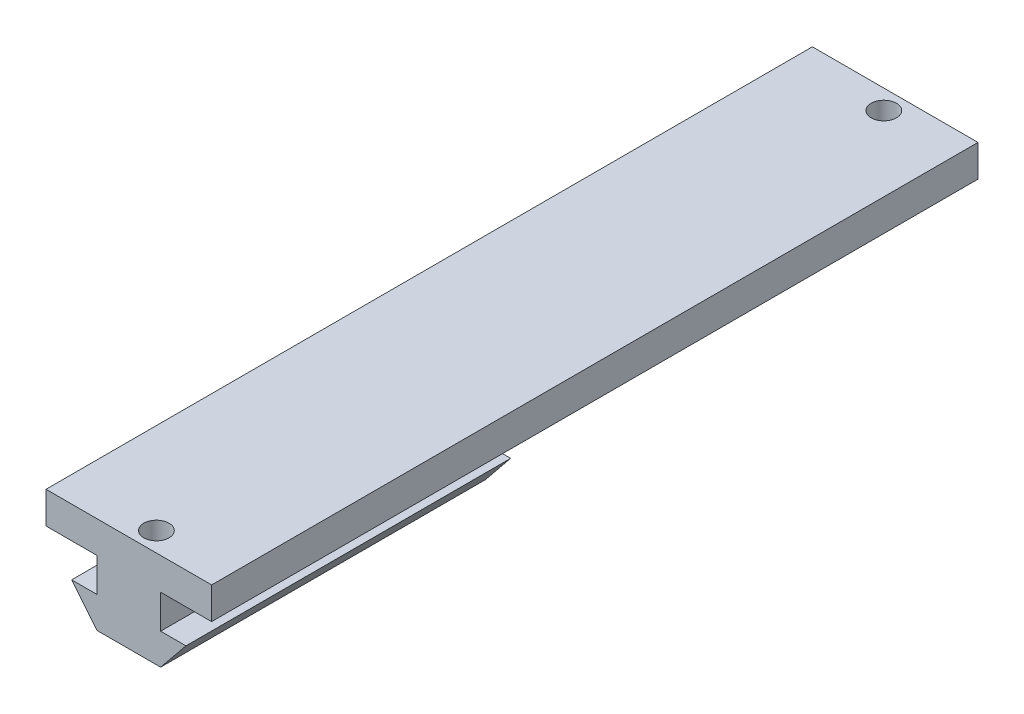
ISO-10303-21;
HEADER;
FILE_DESCRIPTION(('STEP AP214'),'2;1');
FILE_NAME('part.step','',(''),(''),'','','');
FILE_SCHEMA(('AUTOMOTIVE_DESIGN { 1 0 10303 214 1 1 1 1 }'));
ENDSEC;
DATA;
#1=APPLICATION_CONTEXT('core data for automotive mechanical design processes');
#2=APPLICATION_PROTOCOL_DEFINITION('international standard','automotive_design',2000,#1);
#3=PRODUCT_CONTEXT('',#1,'mechanical');
#4=PRODUCT('Part','Part','',(#3));
#5=PRODUCT_RELATED_PRODUCT_CATEGORY('part','',(#4));
#6=PRODUCT_DEFINITION_FORMATION('','',#4);
#7=PRODUCT_DEFINITION_CONTEXT('part definition',#1,'design');
#8=PRODUCT_DEFINITION('design','',#6,#7);
#9=PRODUCT_DEFINITION_SHAPE('','',#8);
#10=(LENGTH_UNIT() NAMED_UNIT(*) SI_UNIT(.MILLI.,.METRE.));
#11=(NAMED_UNIT(*) PLANE_ANGLE_UNIT() SI_UNIT($,.RADIAN.));
#12=(NAMED_UNIT(*) SI_UNIT($,.STERADIAN.) SOLID_ANGLE_UNIT());
#13=UNCERTAINTY_MEASURE_WITH_UNIT(LENGTH_MEASURE(1.E-05),#10,'distance_accuracy_value','');
#14=(GEOMETRIC_REPRESENTATION_CONTEXT(3) GLOBAL_UNCERTAINTY_ASSIGNED_CONTEXT((#13)) GLOBAL_UNIT_ASSIGNED_CONTEXT((#10,
#11,#12)) REPRESENTATION_CONTEXT('',''));
#15=CARTESIAN_POINT('',(0.,0.,0.));
#16=DIRECTION('',(0.,0.,1.));
#17=DIRECTION('',(1.,0.,0.));
#18=AXIS2_PLACEMENT_3D('',#15,#16,#17);
#19=CARTESIAN_POINT('',(12.75,4.9,59.));
#20=DIRECTION('',(-1.,0.,0.));
#21=DIRECTION('',(0.,0.,1.));
#22=AXIS2_PLACEMENT_3D('',#19,#20,#21);
#23=PLANE('',#22);
#24=DIRECTION('',(0.,0.,-1.));
#25=VECTOR('',#24,1.);
#26=CARTESIAN_POINT('',(12.75,0.,59.));
#27=LINE('',#26,#25);
#28=CARTESIAN_POINT('',(12.75,0.,59.));
#29=VERTEX_POINT('',#28);
#30=CARTESIAN_POINT('',(12.75,0.,-59.));
#31=VERTEX_POINT('',#30);
#32=EDGE_CURVE('E203',#29,#31,#27,.T.);
#33=ORIENTED_EDGE('',*,*,#32,.T.);
#34=DIRECTION('',(0.,-1.,0.));
#35=VECTOR('',#34,1.);
#36=CARTESIAN_POINT('',(12.75,4.9,-59.));
#37=LINE('',#36,#35);
#38=CARTESIAN_POINT('',(12.75,4.9,-59.));
#39=VERTEX_POINT('',#38);
#40=EDGE_CURVE('E11',#39,#31,#37,.T.);
#41=ORIENTED_EDGE('',*,*,#40,.F.);
#42=DIRECTION('',(0.,0.,-1.));
#43=VECTOR('',#42,1.);
#44=CARTESIAN_POINT('',(12.75,4.9,59.));
#45=LINE('',#44,#43);
#46=CARTESIAN_POINT('',(12.75,4.9,59.));
#47=VERTEX_POINT('',#46);
#48=EDGE_CURVE('E215',#47,#39,#45,.T.);
#49=ORIENTED_EDGE('',*,*,#48,.F.);
#50=DIRECTION('',(0.,-1.,0.));
#51=VECTOR('',#50,1.);
#52=CARTESIAN_POINT('',(12.75,4.9,59.));
#53=LINE('',#52,#51);
#54=EDGE_CURVE('E222',#47,#29,#53,.T.);
#55=ORIENTED_EDGE('',*,*,#54,.T.);
#56=EDGE_LOOP('',(#33,#41,#49,#55));
#57=FACE_BOUND('',#56,.T.);
#58=ADVANCED_FACE('F45',(#57),#23,.F.);
#59=CARTESIAN_POINT('',(-12.75,4.9,-59.));
#60=DIRECTION('',(0.,0.,1.));
#61=DIRECTION('',(1.,0.,0.));
#62=AXIS2_PLACEMENT_3D('',#59,#60,#61);
#63=PLANE('',#62);
#64=DIRECTION('',(-1.,0.,0.));
#65=VECTOR('',#64,1.);
#66=CARTESIAN_POINT('',(-12.75,0.,-59.));
#67=LINE('',#66,#65);
#68=CARTESIAN_POINT('',(-12.75,0.,-59.));
#69=VERTEX_POINT('',#68);
#70=EDGE_CURVE('E225',#31,#69,#67,.T.);
#71=ORIENTED_EDGE('',*,*,#70,.T.);
#72=DIRECTION('',(0.,-1.,0.));
#73=VECTOR('',#72,1.);
#74=CARTESIAN_POINT('',(-12.75,4.9,-59.));
#75=LINE('',#74,#73);
#76=CARTESIAN_POINT('',(-12.75,4.9,-59.));
#77=VERTEX_POINT('',#76);
#78=EDGE_CURVE('E53',#77,#69,#75,.T.);
#79=ORIENTED_EDGE('',*,*,#78,.F.);
#80=DIRECTION('',(-1.,0.,0.));
#81=VECTOR('',#80,1.);
#82=CARTESIAN_POINT('',(-12.75,4.9,-59.));
#83=LINE('',#82,#81);
#84=EDGE_CURVE('E97',#39,#77,#83,.T.);
#85=ORIENTED_EDGE('',*,*,#84,.F.);
#86=ORIENTED_EDGE('',*,*,#40,.T.);
#87=EDGE_LOOP('',(#71,#79,#85,#86));
#88=FACE_BOUND('',#87,.T.);
#89=ADVANCED_FACE('F262',(#88),#63,.F.);
#90=CARTESIAN_POINT('',(-12.75,4.9,59.));
#91=DIRECTION('',(1.,0.,0.));
#92=DIRECTION('',(0.,0.,-1.));
#93=AXIS2_PLACEMENT_3D('',#90,#91,#92);
#94=PLANE('',#93);
#95=DIRECTION('',(0.,0.,1.));
#96=VECTOR('',#95,1.);
#97=CARTESIAN_POINT('',(-12.75,0.,59.));
#98=LINE('',#97,#96);
#99=CARTESIAN_POINT('',(-12.75,0.,59.));
#100=VERTEX_POINT('',#99);
#101=EDGE_CURVE('E227',#69,#100,#98,.T.);
#102=ORIENTED_EDGE('',*,*,#101,.T.);
#103=DIRECTION('',(0.,-1.,0.));
#104=VECTOR('',#103,1.);
#105=CARTESIAN_POINT('',(-12.75,4.9,59.));
#106=LINE('',#105,#104);
#107=CARTESIAN_POINT('',(-12.75,4.9,59.));
#108=VERTEX_POINT('',#107);
#109=EDGE_CURVE('E231',#108,#100,#106,.T.);
#110=ORIENTED_EDGE('',*,*,#109,.F.);
#111=DIRECTION('',(0.,0.,1.));
#112=VECTOR('',#111,1.);
#113=CARTESIAN_POINT('',(-12.75,4.9,59.));
#114=LINE('',#113,#112);
#115=EDGE_CURVE('E219',#77,#108,#114,.T.);
#116=ORIENTED_EDGE('',*,*,#115,.F.);
#117=ORIENTED_EDGE('',*,*,#78,.T.);
#118=EDGE_LOOP('',(#102,#110,#116,#117));
#119=FACE_BOUND('',#118,.T.);
#120=ADVANCED_FACE('F238',(#119),#94,.F.);
#121=CARTESIAN_POINT('',(-12.75,4.9,59.));
#122=DIRECTION('',(0.,0.,-1.));
#123=DIRECTION('',(-1.,0.,0.));
#124=AXIS2_PLACEMENT_3D('',#121,#122,#123);
#125=PLANE('',#124);
#126=DIRECTION('',(1.,0.,0.));
#127=VECTOR('',#126,1.);
#128=CARTESIAN_POINT('',(-12.75,0.,59.));
#129=LINE('',#128,#127);
#130=CARTESIAN_POINT('',(-4.9,0.,59.));
#131=VERTEX_POINT('',#130);
#132=EDGE_CURVE('E217',#100,#131,#129,.T.);
#133=ORIENTED_EDGE('',*,*,#132,.T.);
#134=DIRECTION('',(0.,-1.,0.));
#135=VECTOR('',#134,1.);
#136=CARTESIAN_POINT('',(-4.9,0.,59.));
#137=LINE('',#136,#135);
#138=CARTESIAN_POINT('',(-4.9,-5.2,59.));
#139=VERTEX_POINT('',#138);
#140=EDGE_CURVE('E60',#131,#139,#137,.T.);
#141=ORIENTED_EDGE('',*,*,#140,.T.);
#142=DIRECTION('',(-1.,0.,0.));
#143=VECTOR('',#142,1.);
#144=CARTESIAN_POINT('',(-4.9,-5.2,59.));
#145=LINE('',#144,#143);
#146=CARTESIAN_POINT('',(-8.8,-5.2,59.));
#147=VERTEX_POINT('',#146);
#148=EDGE_CURVE('E188',#139,#147,#145,.T.);
#149=ORIENTED_EDGE('',*,*,#148,.T.);
#150=DIRECTION('',(0.630592625094466,-0.776114000116266,0.));
#151=VECTOR('',#150,1.);
#152=CARTESIAN_POINT('',(-8.8,-5.2,59.));
#153=LINE('',#152,#151);
#154=CARTESIAN_POINT('',(-4.9,-10.,59.));
#155=VERTEX_POINT('',#154);
#156=EDGE_CURVE('E191',#147,#155,#153,.T.);
#157=ORIENTED_EDGE('',*,*,#156,.T.);
#158=DIRECTION('',(1.,0.,0.));
#159=VECTOR('',#158,1.);
#160=CARTESIAN_POINT('',(-4.9,-10.,59.));
#161=LINE('',#160,#159);
#162=CARTESIAN_POINT('',(4.9,-10.,59.));
#163=VERTEX_POINT('',#162);
#164=EDGE_CURVE('E194',#155,#163,#161,.T.);
#165=ORIENTED_EDGE('',*,*,#164,.T.);
#166=DIRECTION('',(0.630592625094466,0.776114000116266,0.));
#167=VECTOR('',#166,1.);
#168=CARTESIAN_POINT('',(8.8,-5.2,59.));
#169=LINE('',#168,#167);
#170=CARTESIAN_POINT('',(8.8,-5.2,59.));
#171=VERTEX_POINT('',#170);
#172=EDGE_CURVE('E197',#163,#171,#169,.T.);
#173=ORIENTED_EDGE('',*,*,#172,.T.);
#174=DIRECTION('',(-1.,0.,0.));
#175=VECTOR('',#174,1.);
#176=CARTESIAN_POINT('',(4.9,-5.2,59.));
#177=LINE('',#176,#175);
#178=CARTESIAN_POINT('',(4.9,-5.2,59.));
#179=VERTEX_POINT('',#178);
#180=EDGE_CURVE('E167',#171,#179,#177,.T.);
#181=ORIENTED_EDGE('',*,*,#180,.T.);
#182=DIRECTION('',(0.,1.,0.));
#183=VECTOR('',#182,1.);
#184=CARTESIAN_POINT('',(4.9,-5.2,59.));
#185=LINE('',#184,#183);
#186=CARTESIAN_POINT('',(4.9,0.,59.));
#187=VERTEX_POINT('',#186);
#188=EDGE_CURVE('E165',#179,#187,#185,.T.);
#189=ORIENTED_EDGE('',*,*,#188,.T.);
#190=EDGE_CURVE('E90',#187,#29,#129,.T.);
#191=ORIENTED_EDGE('',*,*,#190,.T.);
#192=ORIENTED_EDGE('',*,*,#54,.F.);
#193=DIRECTION('',(1.,0.,0.));
#194=VECTOR('',#193,1.);
#195=CARTESIAN_POINT('',(-12.75,4.9,59.));
#196=LINE('',#195,#194);
#197=EDGE_CURVE('E69',#108,#47,#196,.T.);
#198=ORIENTED_EDGE('',*,*,#197,.F.);
#199=ORIENTED_EDGE('',*,*,#109,.T.);
#200=EDGE_LOOP('',(#133,#141,#149,#157,#165,#173,#181,#189,#191,#192,#198,#199));
#201=FACE_BOUND('',#200,.T.);
#202=ADVANCED_FACE('F241',(#201),#125,.F.);
#203=CARTESIAN_POINT('',(0.,4.9,0.));
#204=DIRECTION('',(0.,-1.,0.));
#205=DIRECTION('',(0.,0.,-1.));
#206=AXIS2_PLACEMENT_3D('',#203,#204,#205);
#207=PLANE('',#206);
#208=CARTESIAN_POINT('',(1.24999999999997,4.9,-56.));
#209=DIRECTION('',(0.,1.,0.));
#210=DIRECTION('',(0.,0.,1.));
#211=AXIS2_PLACEMENT_3D('',#208,#209,#210);
#212=CIRCLE('',#211,1.95);
#213=CARTESIAN_POINT('',(1.24999999999997,4.9,-54.05));
#214=VERTEX_POINT('',#213);
#215=EDGE_CURVE('E381',#214,#214,#212,.T.);
#216=ORIENTED_EDGE('',*,*,#215,.F.);
#217=EDGE_LOOP('',(#216));
#218=FACE_BOUND('',#217,.T.);
#219=CARTESIAN_POINT('',(1.24999999999998,4.9,56.));
#220=DIRECTION('',(0.,1.,0.));
#221=DIRECTION('',(0.,0.,1.));
#222=AXIS2_PLACEMENT_3D('',#219,#220,#221);
#223=CIRCLE('',#222,1.95);
#224=CARTESIAN_POINT('',(1.24999999999998,4.9,57.95));
#225=VERTEX_POINT('',#224);
#226=EDGE_CURVE('E379',#225,#225,#223,.T.);
#227=ORIENTED_EDGE('',*,*,#226,.F.);
#228=EDGE_LOOP('',(#227));
#229=FACE_BOUND('',#228,.T.);
#230=ORIENTED_EDGE('',*,*,#48,.T.);
#231=ORIENTED_EDGE('',*,*,#84,.T.);
#232=ORIENTED_EDGE('',*,*,#115,.T.);
#233=ORIENTED_EDGE('',*,*,#197,.T.);
#234=EDGE_LOOP('',(#230,#231,#232,#233));
#235=FACE_BOUND('',#234,.T.);
#236=ADVANCED_FACE('F245',(#218,#229,#235),#207,.F.);
#237=CARTESIAN_POINT('',(0.,0.,0.));
#238=DIRECTION('',(0.,-1.,0.));
#239=DIRECTION('',(0.,0.,-1.));
#240=AXIS2_PLACEMENT_3D('',#237,#238,#239);
#241=PLANE('',#240);
#242=CARTESIAN_POINT('',(1.24999999999997,0.,-56.));
#243=DIRECTION('',(0.,-1.,0.));
#244=DIRECTION('',(0.,0.,-1.));
#245=AXIS2_PLACEMENT_3D('',#242,#243,#244);
#246=CIRCLE('',#245,1.95);
#247=CARTESIAN_POINT('',(1.24999999999997,0.,-57.95));
#248=VERTEX_POINT('',#247);
#249=EDGE_CURVE('E48',#248,#248,#246,.T.);
#250=ORIENTED_EDGE('',*,*,#249,.F.);
#251=EDGE_LOOP('',(#250));
#252=FACE_BOUND('',#251,.T.);
#253=DIRECTION('',(0.,0.,1.));
#254=VECTOR('',#253,1.);
#255=CARTESIAN_POINT('',(4.9,0.,8.99999999999999));
#256=LINE('',#255,#254);
#257=CARTESIAN_POINT('',(4.9,0.,8.99999999999999));
#258=VERTEX_POINT('',#257);
#259=EDGE_CURVE('E164',#258,#187,#256,.T.);
#260=ORIENTED_EDGE('',*,*,#259,.F.);
#261=DIRECTION('',(-1.,0.,0.));
#262=VECTOR('',#261,1.);
#263=CARTESIAN_POINT('',(4.9,0.,8.99999999999999));
#264=LINE('',#263,#262);
#265=CARTESIAN_POINT('',(-4.9,0.,8.99999999999999));
#266=VERTEX_POINT('',#265);
#267=EDGE_CURVE('E156',#258,#266,#264,.T.);
#268=ORIENTED_EDGE('',*,*,#267,.T.);
#269=DIRECTION('',(0.,0.,1.));
#270=VECTOR('',#269,1.);
#271=CARTESIAN_POINT('',(-4.9,0.,8.99999999999999));
#272=LINE('',#271,#270);
#273=EDGE_CURVE('E141',#266,#131,#272,.T.);
#274=ORIENTED_EDGE('',*,*,#273,.T.);
#275=ORIENTED_EDGE('',*,*,#132,.F.);
#276=ORIENTED_EDGE('',*,*,#101,.F.);
#277=ORIENTED_EDGE('',*,*,#70,.F.);
#278=ORIENTED_EDGE('',*,*,#32,.F.);
#279=ORIENTED_EDGE('',*,*,#190,.F.);
#280=EDGE_LOOP('',(#260,#268,#274,#275,#276,#277,#278,#279));
#281=FACE_BOUND('',#280,.T.);
#282=ADVANCED_FACE('F163',(#252,#281),#241,.T.);
#283=CARTESIAN_POINT('',(4.9,-5.2,8.99999999999999));
#284=DIRECTION('',(1.,0.,0.));
#285=DIRECTION('',(0.,1.,0.));
#286=AXIS2_PLACEMENT_3D('',#283,#284,#285);
#287=PLANE('',#286);
#288=ORIENTED_EDGE('',*,*,#188,.F.);
#289=DIRECTION('',(0.,0.,1.));
#290=VECTOR('',#289,1.);
#291=CARTESIAN_POINT('',(4.9,-5.2,8.99999999999999));
#292=LINE('',#291,#290);
#293=CARTESIAN_POINT('',(4.9,-5.2,8.99999999999999));
#294=VERTEX_POINT('',#293);
#295=EDGE_CURVE('E204',#294,#179,#292,.T.);
#296=ORIENTED_EDGE('',*,*,#295,.F.);
#297=DIRECTION('',(0.,1.,0.));
#298=VECTOR('',#297,1.);
#299=CARTESIAN_POINT('',(4.9,-5.2,8.99999999999999));
#300=LINE('',#299,#298);
#301=EDGE_CURVE('E150',#294,#258,#300,.T.);
#302=ORIENTED_EDGE('',*,*,#301,.T.);
#303=ORIENTED_EDGE('',*,*,#259,.T.);
#304=EDGE_LOOP('',(#288,#296,#302,#303));
#305=FACE_BOUND('',#304,.T.);
#306=ADVANCED_FACE('F253',(#305),#287,.T.);
#307=CARTESIAN_POINT('',(4.9,-5.2,8.99999999999999));
#308=DIRECTION('',(0.,1.,0.));
#309=DIRECTION('',(0.,0.,1.));
#310=AXIS2_PLACEMENT_3D('',#307,#308,#309);
#311=PLANE('',#310);
#312=ORIENTED_EDGE('',*,*,#180,.F.);
#313=DIRECTION('',(0.,0.,1.));
#314=VECTOR('',#313,1.);
#315=CARTESIAN_POINT('',(8.8,-5.2,8.99999999999999));
#316=LINE('',#315,#314);
#317=CARTESIAN_POINT('',(8.8,-5.2,8.99999999999999));
#318=VERTEX_POINT('',#317);
#319=EDGE_CURVE('E206',#318,#171,#316,.T.);
#320=ORIENTED_EDGE('',*,*,#319,.F.);
#321=DIRECTION('',(-1.,0.,0.));
#322=VECTOR('',#321,1.);
#323=CARTESIAN_POINT('',(4.9,-5.2,8.99999999999999));
#324=LINE('',#323,#322);
#325=EDGE_CURVE('E183',#318,#294,#324,.T.);
#326=ORIENTED_EDGE('',*,*,#325,.T.);
#327=ORIENTED_EDGE('',*,*,#295,.T.);
#328=EDGE_LOOP('',(#312,#320,#326,#327));
#329=FACE_BOUND('',#328,.T.);
#330=ADVANCED_FACE('F285',(#329),#311,.T.);
#331=CARTESIAN_POINT('',(8.8,-5.2,8.99999999999999));
#332=DIRECTION('',(0.776114000116266,-0.630592625094465,0.));
#333=DIRECTION('',(0.630592625094465,0.776114000116266,0.));
#334=AXIS2_PLACEMENT_3D('',#331,#332,#333);
#335=PLANE('',#334);
#336=ORIENTED_EDGE('',*,*,#172,.F.);
#337=DIRECTION('',(0.,0.,1.));
#338=VECTOR('',#337,1.);
#339=CARTESIAN_POINT('',(4.9,-10.,8.99999999999999));
#340=LINE('',#339,#338);
#341=CARTESIAN_POINT('',(4.9,-10.,8.99999999999999));
#342=VERTEX_POINT('',#341);
#343=EDGE_CURVE('E208',#342,#163,#340,.T.);
#344=ORIENTED_EDGE('',*,*,#343,.F.);
#345=DIRECTION('',(0.630592625094466,0.776114000116266,0.));
#346=VECTOR('',#345,1.);
#347=CARTESIAN_POINT('',(8.8,-5.2,8.99999999999999));
#348=LINE('',#347,#346);
#349=EDGE_CURVE('E180',#342,#318,#348,.T.);
#350=ORIENTED_EDGE('',*,*,#349,.T.);
#351=ORIENTED_EDGE('',*,*,#319,.T.);
#352=EDGE_LOOP('',(#336,#344,#350,#351));
#353=FACE_BOUND('',#352,.T.);
#354=ADVANCED_FACE('F294',(#353),#335,.T.);
#355=CARTESIAN_POINT('',(-4.9,-10.,8.99999999999999));
#356=DIRECTION('',(0.,-1.,0.));
#357=DIRECTION('',(1.,0.,0.));
#358=AXIS2_PLACEMENT_3D('',#355,#356,#357);
#359=PLANE('',#358);
#360=ORIENTED_EDGE('',*,*,#164,.F.);
#361=DIRECTION('',(0.,0.,1.));
#362=VECTOR('',#361,1.);
#363=CARTESIAN_POINT('',(-4.9,-10.,8.99999999999999));
#364=LINE('',#363,#362);
#365=CARTESIAN_POINT('',(-4.9,-10.,8.99999999999999));
#366=VERTEX_POINT('',#365);
#367=EDGE_CURVE('E210',#366,#155,#364,.T.);
#368=ORIENTED_EDGE('',*,*,#367,.F.);
#369=DIRECTION('',(1.,0.,0.));
#370=VECTOR('',#369,1.);
#371=CARTESIAN_POINT('',(-4.9,-10.,8.99999999999999));
#372=LINE('',#371,#370);
#373=EDGE_CURVE('E177',#366,#342,#372,.T.);
#374=ORIENTED_EDGE('',*,*,#373,.T.);
#375=ORIENTED_EDGE('',*,*,#343,.T.);
#376=EDGE_LOOP('',(#360,#368,#374,#375));
#377=FACE_BOUND('',#376,.T.);
#378=ADVANCED_FACE('F303',(#377),#359,.T.);
#379=CARTESIAN_POINT('',(-8.8,-5.2,8.99999999999999));
#380=DIRECTION('',(-0.776114000116266,-0.630592625094466,0.));
#381=DIRECTION('',(0.630592625094466,-0.776114000116266,0.));
#382=AXIS2_PLACEMENT_3D('',#379,#380,#381);
#383=PLANE('',#382);
#384=ORIENTED_EDGE('',*,*,#156,.F.);
#385=DIRECTION('',(0.,0.,1.));
#386=VECTOR('',#385,1.);
#387=CARTESIAN_POINT('',(-8.8,-5.2,8.99999999999999));
#388=LINE('',#387,#386);
#389=CARTESIAN_POINT('',(-8.8,-5.2,8.99999999999999));
#390=VERTEX_POINT('',#389);
#391=EDGE_CURVE('E212',#390,#147,#388,.T.);
#392=ORIENTED_EDGE('',*,*,#391,.F.);
#393=DIRECTION('',(0.630592625094466,-0.776114000116266,0.));
#394=VECTOR('',#393,1.);
#395=CARTESIAN_POINT('',(-8.8,-5.2,8.99999999999999));
#396=LINE('',#395,#394);
#397=EDGE_CURVE('E174',#390,#366,#396,.T.);
#398=ORIENTED_EDGE('',*,*,#397,.T.);
#399=ORIENTED_EDGE('',*,*,#367,.T.);
#400=EDGE_LOOP('',(#384,#392,#398,#399));
#401=FACE_BOUND('',#400,.T.);
#402=ADVANCED_FACE('F312',(#401),#383,.T.);
#403=CARTESIAN_POINT('',(-4.9,-5.2,8.99999999999999));
#404=DIRECTION('',(0.,1.,0.));
#405=DIRECTION('',(-1.,0.,0.));
#406=AXIS2_PLACEMENT_3D('',#403,#404,#405);
#407=PLANE('',#406);
#408=ORIENTED_EDGE('',*,*,#148,.F.);
#409=DIRECTION('',(0.,0.,1.));
#410=VECTOR('',#409,1.);
#411=CARTESIAN_POINT('',(-4.9,-5.2,8.99999999999999));
#412=LINE('',#411,#410);
#413=CARTESIAN_POINT('',(-4.9,-5.2,8.99999999999999));
#414=VERTEX_POINT('',#413);
#415=EDGE_CURVE('E149',#414,#139,#412,.T.);
#416=ORIENTED_EDGE('',*,*,#415,.F.);
#417=DIRECTION('',(-1.,0.,0.));
#418=VECTOR('',#417,1.);
#419=CARTESIAN_POINT('',(-4.9,-5.2,8.99999999999999));
#420=LINE('',#419,#418);
#421=EDGE_CURVE('E160',#414,#390,#420,.T.);
#422=ORIENTED_EDGE('',*,*,#421,.T.);
#423=ORIENTED_EDGE('',*,*,#391,.T.);
#424=EDGE_LOOP('',(#408,#416,#422,#423));
#425=FACE_BOUND('',#424,.T.);
#426=ADVANCED_FACE('F321',(#425),#407,.T.);
#427=CARTESIAN_POINT('',(-4.9,0.,8.99999999999999));
#428=DIRECTION('',(-1.,0.,0.));
#429=DIRECTION('',(0.,-1.,0.));
#430=AXIS2_PLACEMENT_3D('',#427,#428,#429);
#431=PLANE('',#430);
#432=ORIENTED_EDGE('',*,*,#140,.F.);
#433=ORIENTED_EDGE('',*,*,#273,.F.);
#434=DIRECTION('',(0.,-1.,0.));
#435=VECTOR('',#434,1.);
#436=CARTESIAN_POINT('',(-4.9,0.,8.99999999999999));
#437=LINE('',#436,#435);
#438=EDGE_CURVE('E144',#266,#414,#437,.T.);
#439=ORIENTED_EDGE('',*,*,#438,.T.);
#440=ORIENTED_EDGE('',*,*,#415,.T.);
#441=EDGE_LOOP('',(#432,#433,#439,#440));
#442=FACE_BOUND('',#441,.T.);
#443=ADVANCED_FACE('F143',(#442),#431,.T.);
#444=CARTESIAN_POINT('',(0.,0.,8.99999999999999));
#445=DIRECTION('',(0.,0.,1.));
#446=DIRECTION('',(1.,0.,0.));
#447=AXIS2_PLACEMENT_3D('',#444,#445,#446);
#448=PLANE('',#447);
#449=ORIENTED_EDGE('',*,*,#267,.F.);
#450=ORIENTED_EDGE('',*,*,#301,.F.);
#451=ORIENTED_EDGE('',*,*,#325,.F.);
#452=ORIENTED_EDGE('',*,*,#349,.F.);
#453=ORIENTED_EDGE('',*,*,#373,.F.);
#454=ORIENTED_EDGE('',*,*,#397,.F.);
#455=ORIENTED_EDGE('',*,*,#421,.F.);
#456=ORIENTED_EDGE('',*,*,#438,.F.);
#457=EDGE_LOOP('',(#449,#450,#451,#452,#453,#454,#455,#456));
#458=FACE_BOUND('',#457,.T.);
#459=ADVANCED_FACE('F154',(#458),#448,.F.);
#460=CARTESIAN_POINT('',(1.24999999999997,-5.1,-56.));
#461=DIRECTION('',(0.,1.,0.));
#462=DIRECTION('',(0.,0.,1.));
#463=AXIS2_PLACEMENT_3D('',#460,#461,#462);
#464=CYLINDRICAL_SURFACE('',#463,1.95);
#465=ORIENTED_EDGE('',*,*,#249,.T.);
#466=EDGE_LOOP('',(#465));
#467=FACE_BOUND('',#466,.T.);
#468=ORIENTED_EDGE('',*,*,#215,.T.);
#469=EDGE_LOOP('',(#468));
#470=FACE_BOUND('',#469,.T.);
#471=ADVANCED_FACE('F342',(#467,#470),#464,.F.);
#472=CARTESIAN_POINT('',(1.24999999999998,-5.1,56.));
#473=DIRECTION('',(0.,1.,0.));
#474=DIRECTION('',(0.,0.,1.));
#475=AXIS2_PLACEMENT_3D('',#472,#473,#474);
#476=CYLINDRICAL_SURFACE('',#475,1.95);
#477=CARTESIAN_POINT('',(1.24999999999998,-5.1,56.));
#478=DIRECTION('',(0.,1.,0.));
#479=DIRECTION('',(0.,0.,1.));
#480=AXIS2_PLACEMENT_3D('',#477,#478,#479);
#481=CIRCLE('',#480,1.95);
#482=CARTESIAN_POINT('',(1.24999999999998,-5.1,57.95));
#483=VERTEX_POINT('',#482);
#484=EDGE_CURVE('E170',#483,#483,#481,.T.);
#485=ORIENTED_EDGE('',*,*,#484,.F.);
#486=EDGE_LOOP('',(#485));
#487=FACE_BOUND('',#486,.T.);
#488=ORIENTED_EDGE('',*,*,#226,.T.);
#489=EDGE_LOOP('',(#488));
#490=FACE_BOUND('',#489,.T.);
#491=ADVANCED_FACE('F354',(#487,#490),#476,.F.);
#492=CARTESIAN_POINT('',(1.24999999999998,-5.1,56.));
#493=DIRECTION('',(0.,1.,0.));
#494=DIRECTION('',(0.,0.,1.));
#495=AXIS2_PLACEMENT_3D('',#492,#493,#494);
#496=PLANE('',#495);
#497=ORIENTED_EDGE('',*,*,#484,.T.);
#498=EDGE_LOOP('',(#497));
#499=FACE_BOUND('',#498,.T.);
#500=ADVANCED_FACE('F364',(#499),#496,.T.);
#501=CLOSED_SHELL('',(#58,#89,#120,#202,#236,#282,#306,#330,#354,#378,#402,#426,#443,#459,#471,
#491,#500));
#502=MANIFOLD_SOLID_BREP('B2',#501);
#503=ADVANCED_BREP_SHAPE_REPRESENTATION('',(#18,#502),#14);
#504=SHAPE_DEFINITION_REPRESENTATION(#9,#503);
ENDSEC;
END-ISO-10303-21;
